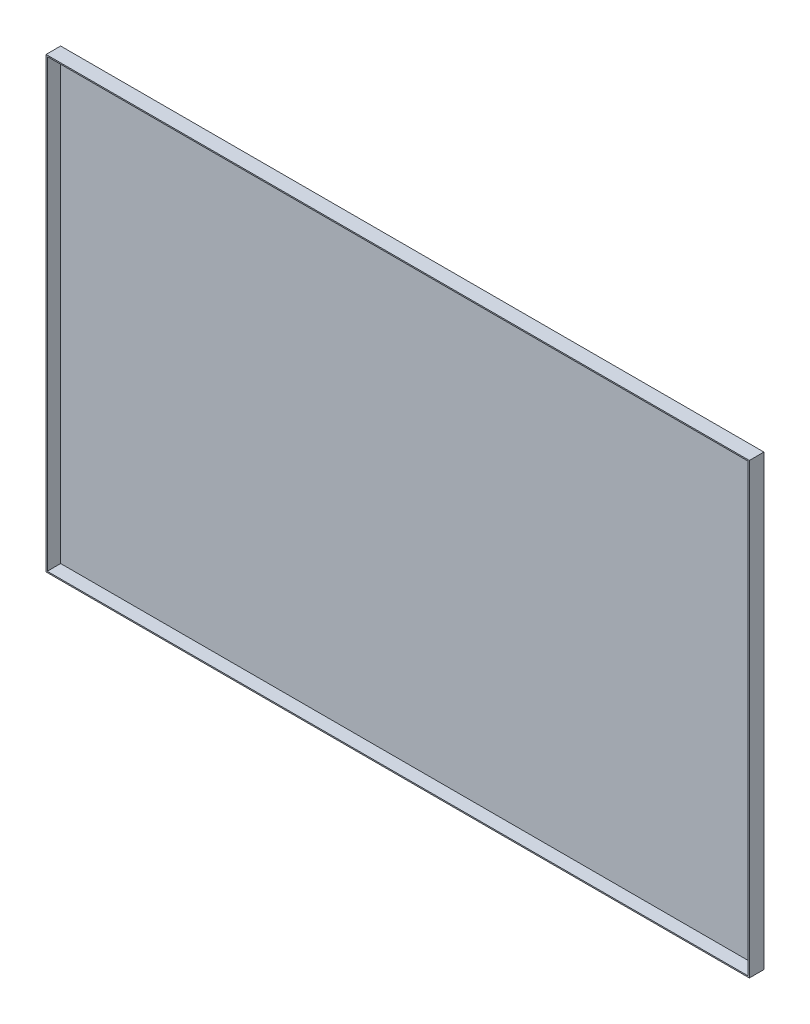
ISO-10303-21;
HEADER;
FILE_DESCRIPTION(('STEP AP214'),'2;1');
FILE_NAME('part.step','',(''),(''),'','','');
FILE_SCHEMA(('AUTOMOTIVE_DESIGN { 1 0 10303 214 1 1 1 1 }'));
ENDSEC;
DATA;
#1=APPLICATION_CONTEXT('core data for automotive mechanical design processes');
#2=APPLICATION_PROTOCOL_DEFINITION('international standard','automotive_design',2000,#1);
#3=PRODUCT_CONTEXT('',#1,'mechanical');
#4=PRODUCT('Part','Part','',(#3));
#5=PRODUCT_RELATED_PRODUCT_CATEGORY('part','',(#4));
#6=PRODUCT_DEFINITION_FORMATION('','',#4);
#7=PRODUCT_DEFINITION_CONTEXT('part definition',#1,'design');
#8=PRODUCT_DEFINITION('design','',#6,#7);
#9=PRODUCT_DEFINITION_SHAPE('','',#8);
#10=(LENGTH_UNIT() NAMED_UNIT(*) SI_UNIT(.MILLI.,.METRE.));
#11=(NAMED_UNIT(*) PLANE_ANGLE_UNIT() SI_UNIT($,.RADIAN.));
#12=(NAMED_UNIT(*) SI_UNIT($,.STERADIAN.) SOLID_ANGLE_UNIT());
#13=UNCERTAINTY_MEASURE_WITH_UNIT(LENGTH_MEASURE(1.E-05),#10,'distance_accuracy_value','');
#14=(GEOMETRIC_REPRESENTATION_CONTEXT(3) GLOBAL_UNCERTAINTY_ASSIGNED_CONTEXT((#13)) GLOBAL_UNIT_ASSIGNED_CONTEXT((#10,
#11,#12)) REPRESENTATION_CONTEXT('',''));
#15=CARTESIAN_POINT('',(0.,0.,0.));
#16=DIRECTION('',(0.,0.,1.));
#17=DIRECTION('',(1.,0.,0.));
#18=AXIS2_PLACEMENT_3D('',#15,#16,#17);
#19=CARTESIAN_POINT('',(289.5,184.5,12.));
#20=DIRECTION('',(-1.,0.,0.));
#21=DIRECTION('',(0.,0.,1.));
#22=AXIS2_PLACEMENT_3D('',#19,#20,#21);
#23=PLANE('',#22);
#24=DIRECTION('',(0.,1.,0.));
#25=VECTOR('',#24,1.);
#26=CARTESIAN_POINT('',(289.5,184.5,0.));
#27=LINE('',#26,#25);
#28=CARTESIAN_POINT('',(289.5,-184.5,0.));
#29=VERTEX_POINT('',#28);
#30=CARTESIAN_POINT('',(289.5,184.5,0.));
#31=VERTEX_POINT('',#30);
#32=EDGE_CURVE('E167',#29,#31,#27,.T.);
#33=ORIENTED_EDGE('',*,*,#32,.T.);
#34=DIRECTION('',(0.,0.,-1.));
#35=VECTOR('',#34,1.);
#36=CARTESIAN_POINT('',(289.5,184.5,12.));
#37=LINE('',#36,#35);
#38=CARTESIAN_POINT('',(289.5,184.5,12.));
#39=VERTEX_POINT('',#38);
#40=EDGE_CURVE('E11',#39,#31,#37,.T.);
#41=ORIENTED_EDGE('',*,*,#40,.F.);
#42=DIRECTION('',(0.,1.,0.));
#43=VECTOR('',#42,1.);
#44=CARTESIAN_POINT('',(289.5,184.5,12.));
#45=LINE('',#44,#43);
#46=CARTESIAN_POINT('',(289.5,-184.5,12.));
#47=VERTEX_POINT('',#46);
#48=EDGE_CURVE('E156',#47,#39,#45,.T.);
#49=ORIENTED_EDGE('',*,*,#48,.F.);
#50=DIRECTION('',(0.,0.,-1.));
#51=VECTOR('',#50,1.);
#52=CARTESIAN_POINT('',(289.5,-184.5,12.));
#53=LINE('',#52,#51);
#54=EDGE_CURVE('E166',#47,#29,#53,.T.);
#55=ORIENTED_EDGE('',*,*,#54,.T.);
#56=EDGE_LOOP('',(#33,#41,#49,#55));
#57=FACE_BOUND('',#56,.T.);
#58=ADVANCED_FACE('F39',(#57),#23,.F.);
#59=CARTESIAN_POINT('',(-289.5,184.5,12.));
#60=DIRECTION('',(0.,-1.,0.));
#61=DIRECTION('',(0.,0.,-1.));
#62=AXIS2_PLACEMENT_3D('',#59,#60,#61);
#63=PLANE('',#62);
#64=DIRECTION('',(-1.,0.,0.));
#65=VECTOR('',#64,1.);
#66=CARTESIAN_POINT('',(-289.5,184.5,0.));
#67=LINE('',#66,#65);
#68=CARTESIAN_POINT('',(-289.5,184.5,0.));
#69=VERTEX_POINT('',#68);
#70=EDGE_CURVE('E171',#31,#69,#67,.T.);
#71=ORIENTED_EDGE('',*,*,#70,.T.);
#72=DIRECTION('',(0.,0.,-1.));
#73=VECTOR('',#72,1.);
#74=CARTESIAN_POINT('',(-289.5,184.5,12.));
#75=LINE('',#74,#73);
#76=CARTESIAN_POINT('',(-289.5,184.5,12.));
#77=VERTEX_POINT('',#76);
#78=EDGE_CURVE('E47',#77,#69,#75,.T.);
#79=ORIENTED_EDGE('',*,*,#78,.F.);
#80=DIRECTION('',(-1.,0.,0.));
#81=VECTOR('',#80,1.);
#82=CARTESIAN_POINT('',(-289.5,184.5,12.));
#83=LINE('',#82,#81);
#84=EDGE_CURVE('E91',#39,#77,#83,.T.);
#85=ORIENTED_EDGE('',*,*,#84,.F.);
#86=ORIENTED_EDGE('',*,*,#40,.T.);
#87=EDGE_LOOP('',(#71,#79,#85,#86));
#88=FACE_BOUND('',#87,.T.);
#89=ADVANCED_FACE('F206',(#88),#63,.F.);
#90=CARTESIAN_POINT('',(-289.5,184.5,12.));
#91=DIRECTION('',(1.,0.,0.));
#92=DIRECTION('',(0.,0.,-1.));
#93=AXIS2_PLACEMENT_3D('',#90,#91,#92);
#94=PLANE('',#93);
#95=DIRECTION('',(0.,-1.,0.));
#96=VECTOR('',#95,1.);
#97=CARTESIAN_POINT('',(-289.5,184.5,0.));
#98=LINE('',#97,#96);
#99=CARTESIAN_POINT('',(-289.5,-184.5,0.));
#100=VERTEX_POINT('',#99);
#101=EDGE_CURVE('E174',#69,#100,#98,.T.);
#102=ORIENTED_EDGE('',*,*,#101,.T.);
#103=DIRECTION('',(0.,0.,-1.));
#104=VECTOR('',#103,1.);
#105=CARTESIAN_POINT('',(-289.5,-184.5,12.));
#106=LINE('',#105,#104);
#107=CARTESIAN_POINT('',(-289.5,-184.5,12.));
#108=VERTEX_POINT('',#107);
#109=EDGE_CURVE('E181',#108,#100,#106,.T.);
#110=ORIENTED_EDGE('',*,*,#109,.F.);
#111=DIRECTION('',(0.,-1.,0.));
#112=VECTOR('',#111,1.);
#113=CARTESIAN_POINT('',(-289.5,184.5,12.));
#114=LINE('',#113,#112);
#115=EDGE_CURVE('E161',#77,#108,#114,.T.);
#116=ORIENTED_EDGE('',*,*,#115,.F.);
#117=ORIENTED_EDGE('',*,*,#78,.T.);
#118=EDGE_LOOP('',(#102,#110,#116,#117));
#119=FACE_BOUND('',#118,.T.);
#120=ADVANCED_FACE('F188',(#119),#94,.F.);
#121=CARTESIAN_POINT('',(-289.5,-184.5,12.));
#122=DIRECTION('',(0.,1.,0.));
#123=DIRECTION('',(0.,0.,1.));
#124=AXIS2_PLACEMENT_3D('',#121,#122,#123);
#125=PLANE('',#124);
#126=DIRECTION('',(1.,0.,0.));
#127=VECTOR('',#126,1.);
#128=CARTESIAN_POINT('',(-289.5,-184.5,0.));
#129=LINE('',#128,#127);
#130=EDGE_CURVE('E84',#100,#29,#129,.T.);
#131=ORIENTED_EDGE('',*,*,#130,.T.);
#132=ORIENTED_EDGE('',*,*,#54,.F.);
#133=DIRECTION('',(1.,0.,0.));
#134=VECTOR('',#133,1.);
#135=CARTESIAN_POINT('',(-289.5,-184.5,12.));
#136=LINE('',#135,#134);
#137=EDGE_CURVE('E63',#108,#47,#136,.T.);
#138=ORIENTED_EDGE('',*,*,#137,.F.);
#139=ORIENTED_EDGE('',*,*,#109,.T.);
#140=EDGE_LOOP('',(#131,#132,#138,#139));
#141=FACE_BOUND('',#140,.T.);
#142=ADVANCED_FACE('F196',(#141),#125,.F.);
#143=CARTESIAN_POINT('',(0.,0.,12.));
#144=DIRECTION('',(0.,0.,1.));
#145=DIRECTION('',(1.,0.,0.));
#146=AXIS2_PLACEMENT_3D('',#143,#144,#145);
#147=PLANE('',#146);
#148=DIRECTION('',(0.,1.,0.));
#149=VECTOR('',#148,1.);
#150=CARTESIAN_POINT('',(288.5,184.5,12.));
#151=LINE('',#150,#149);
#152=CARTESIAN_POINT('',(288.5,-183.5,12.));
#153=VERTEX_POINT('',#152);
#154=CARTESIAN_POINT('',(288.5,183.5,12.));
#155=VERTEX_POINT('',#154);
#156=EDGE_CURVE('E140',#153,#155,#151,.T.);
#157=ORIENTED_EDGE('',*,*,#156,.F.);
#158=DIRECTION('',(1.,0.,0.));
#159=VECTOR('',#158,1.);
#160=CARTESIAN_POINT('',(-289.5,-183.5,12.));
#161=LINE('',#160,#159);
#162=CARTESIAN_POINT('',(-288.5,-183.5,12.));
#163=VERTEX_POINT('',#162);
#164=EDGE_CURVE('E153',#163,#153,#161,.T.);
#165=ORIENTED_EDGE('',*,*,#164,.F.);
#166=DIRECTION('',(0.,-1.,0.));
#167=VECTOR('',#166,1.);
#168=CARTESIAN_POINT('',(-288.5,184.5,12.));
#169=LINE('',#168,#167);
#170=CARTESIAN_POINT('',(-288.5,183.5,12.));
#171=VERTEX_POINT('',#170);
#172=EDGE_CURVE('E150',#171,#163,#169,.T.);
#173=ORIENTED_EDGE('',*,*,#172,.F.);
#174=DIRECTION('',(-1.,0.,0.));
#175=VECTOR('',#174,1.);
#176=CARTESIAN_POINT('',(-289.5,183.5,12.));
#177=LINE('',#176,#175);
#178=EDGE_CURVE('E129',#155,#171,#177,.T.);
#179=ORIENTED_EDGE('',*,*,#178,.F.);
#180=EDGE_LOOP('',(#157,#165,#173,#179));
#181=FACE_BOUND('',#180,.T.);
#182=ORIENTED_EDGE('',*,*,#48,.T.);
#183=ORIENTED_EDGE('',*,*,#84,.T.);
#184=ORIENTED_EDGE('',*,*,#115,.T.);
#185=ORIENTED_EDGE('',*,*,#137,.T.);
#186=EDGE_LOOP('',(#182,#183,#184,#185));
#187=FACE_BOUND('',#186,.T.);
#188=ADVANCED_FACE('F198',(#181,#187),#147,.T.);
#189=CARTESIAN_POINT('',(0.,0.,0.));
#190=DIRECTION('',(0.,0.,1.));
#191=DIRECTION('',(1.,0.,0.));
#192=AXIS2_PLACEMENT_3D('',#189,#190,#191);
#193=PLANE('',#192);
#194=ORIENTED_EDGE('',*,*,#32,.F.);
#195=ORIENTED_EDGE('',*,*,#130,.F.);
#196=ORIENTED_EDGE('',*,*,#101,.F.);
#197=ORIENTED_EDGE('',*,*,#70,.F.);
#198=EDGE_LOOP('',(#194,#195,#196,#197));
#199=FACE_BOUND('',#198,.T.);
#200=ADVANCED_FACE('F192',(#199),#193,.F.);
#201=CARTESIAN_POINT('',(288.5,184.5,12.));
#202=DIRECTION('',(-1.,0.,0.));
#203=DIRECTION('',(0.,0.,1.));
#204=AXIS2_PLACEMENT_3D('',#201,#202,#203);
#205=PLANE('',#204);
#206=DIRECTION('',(0.,1.,0.));
#207=VECTOR('',#206,1.);
#208=CARTESIAN_POINT('',(288.5,184.5,1.));
#209=LINE('',#208,#207);
#210=CARTESIAN_POINT('',(288.5,-183.5,1.));
#211=VERTEX_POINT('',#210);
#212=CARTESIAN_POINT('',(288.5,183.5,1.));
#213=VERTEX_POINT('',#212);
#214=EDGE_CURVE('E119',#211,#213,#209,.T.);
#215=ORIENTED_EDGE('',*,*,#214,.F.);
#216=DIRECTION('',(0.,0.,-1.));
#217=VECTOR('',#216,1.);
#218=CARTESIAN_POINT('',(288.5,-183.5,12.));
#219=LINE('',#218,#217);
#220=EDGE_CURVE('E144',#153,#211,#219,.T.);
#221=ORIENTED_EDGE('',*,*,#220,.F.);
#222=ORIENTED_EDGE('',*,*,#156,.T.);
#223=DIRECTION('',(0.,0.,-1.));
#224=VECTOR('',#223,1.);
#225=CARTESIAN_POINT('',(288.5,183.5,12.));
#226=LINE('',#225,#224);
#227=EDGE_CURVE('E133',#155,#213,#226,.T.);
#228=ORIENTED_EDGE('',*,*,#227,.T.);
#229=EDGE_LOOP('',(#215,#221,#222,#228));
#230=FACE_BOUND('',#229,.T.);
#231=ADVANCED_FACE('F233',(#230),#205,.T.);
#232=CARTESIAN_POINT('',(-289.5,183.5,12.));
#233=DIRECTION('',(0.,-1.,0.));
#234=DIRECTION('',(0.,0.,-1.));
#235=AXIS2_PLACEMENT_3D('',#232,#233,#234);
#236=PLANE('',#235);
#237=DIRECTION('',(-1.,0.,0.));
#238=VECTOR('',#237,1.);
#239=CARTESIAN_POINT('',(-289.5,183.5,1.));
#240=LINE('',#239,#238);
#241=CARTESIAN_POINT('',(-288.5,183.5,1.));
#242=VERTEX_POINT('',#241);
#243=EDGE_CURVE('E113',#213,#242,#240,.T.);
#244=ORIENTED_EDGE('',*,*,#243,.F.);
#245=ORIENTED_EDGE('',*,*,#227,.F.);
#246=ORIENTED_EDGE('',*,*,#178,.T.);
#247=DIRECTION('',(0.,0.,-1.));
#248=VECTOR('',#247,1.);
#249=CARTESIAN_POINT('',(-288.5,183.5,12.));
#250=LINE('',#249,#248);
#251=EDGE_CURVE('E126',#171,#242,#250,.T.);
#252=ORIENTED_EDGE('',*,*,#251,.T.);
#253=EDGE_LOOP('',(#244,#245,#246,#252));
#254=FACE_BOUND('',#253,.T.);
#255=ADVANCED_FACE('F127',(#254),#236,.T.);
#256=CARTESIAN_POINT('',(-288.5,184.5,12.));
#257=DIRECTION('',(1.,0.,0.));
#258=DIRECTION('',(0.,0.,-1.));
#259=AXIS2_PLACEMENT_3D('',#256,#257,#258);
#260=PLANE('',#259);
#261=DIRECTION('',(0.,-1.,0.));
#262=VECTOR('',#261,1.);
#263=CARTESIAN_POINT('',(-288.5,184.5,1.));
#264=LINE('',#263,#262);
#265=CARTESIAN_POINT('',(-288.5,-183.5,1.));
#266=VERTEX_POINT('',#265);
#267=EDGE_CURVE('E117',#242,#266,#264,.T.);
#268=ORIENTED_EDGE('',*,*,#267,.F.);
#269=ORIENTED_EDGE('',*,*,#251,.F.);
#270=ORIENTED_EDGE('',*,*,#172,.T.);
#271=DIRECTION('',(0.,0.,-1.));
#272=VECTOR('',#271,1.);
#273=CARTESIAN_POINT('',(-288.5,-183.5,12.));
#274=LINE('',#273,#272);
#275=EDGE_CURVE('E54',#163,#266,#274,.T.);
#276=ORIENTED_EDGE('',*,*,#275,.T.);
#277=EDGE_LOOP('',(#268,#269,#270,#276));
#278=FACE_BOUND('',#277,.T.);
#279=ADVANCED_FACE('F135',(#278),#260,.T.);
#280=CARTESIAN_POINT('',(-289.5,-183.5,12.));
#281=DIRECTION('',(0.,1.,0.));
#282=DIRECTION('',(0.,0.,1.));
#283=AXIS2_PLACEMENT_3D('',#280,#281,#282);
#284=PLANE('',#283);
#285=DIRECTION('',(1.,0.,0.));
#286=VECTOR('',#285,1.);
#287=CARTESIAN_POINT('',(-289.5,-183.5,1.));
#288=LINE('',#287,#286);
#289=EDGE_CURVE('E137',#266,#211,#288,.T.);
#290=ORIENTED_EDGE('',*,*,#289,.F.);
#291=ORIENTED_EDGE('',*,*,#275,.F.);
#292=ORIENTED_EDGE('',*,*,#164,.T.);
#293=ORIENTED_EDGE('',*,*,#220,.T.);
#294=EDGE_LOOP('',(#290,#291,#292,#293));
#295=FACE_BOUND('',#294,.T.);
#296=ADVANCED_FACE('F263',(#295),#284,.T.);
#297=CARTESIAN_POINT('',(0.,0.,1.));
#298=DIRECTION('',(0.,0.,1.));
#299=DIRECTION('',(1.,0.,0.));
#300=AXIS2_PLACEMENT_3D('',#297,#298,#299);
#301=PLANE('',#300);
#302=ORIENTED_EDGE('',*,*,#214,.T.);
#303=ORIENTED_EDGE('',*,*,#243,.T.);
#304=ORIENTED_EDGE('',*,*,#267,.T.);
#305=ORIENTED_EDGE('',*,*,#289,.T.);
#306=EDGE_LOOP('',(#302,#303,#304,#305));
#307=FACE_BOUND('',#306,.T.);
#308=ADVANCED_FACE('F115',(#307),#301,.T.);
#309=CLOSED_SHELL('',(#58,#89,#120,#142,#188,#200,#231,#255,#279,#296,#308));
#310=MANIFOLD_SOLID_BREP('B2',#309);
#311=ADVANCED_BREP_SHAPE_REPRESENTATION('',(#18,#310),#14);
#312=SHAPE_DEFINITION_REPRESENTATION(#9,#311);
ENDSEC;
END-ISO-10303-21;
